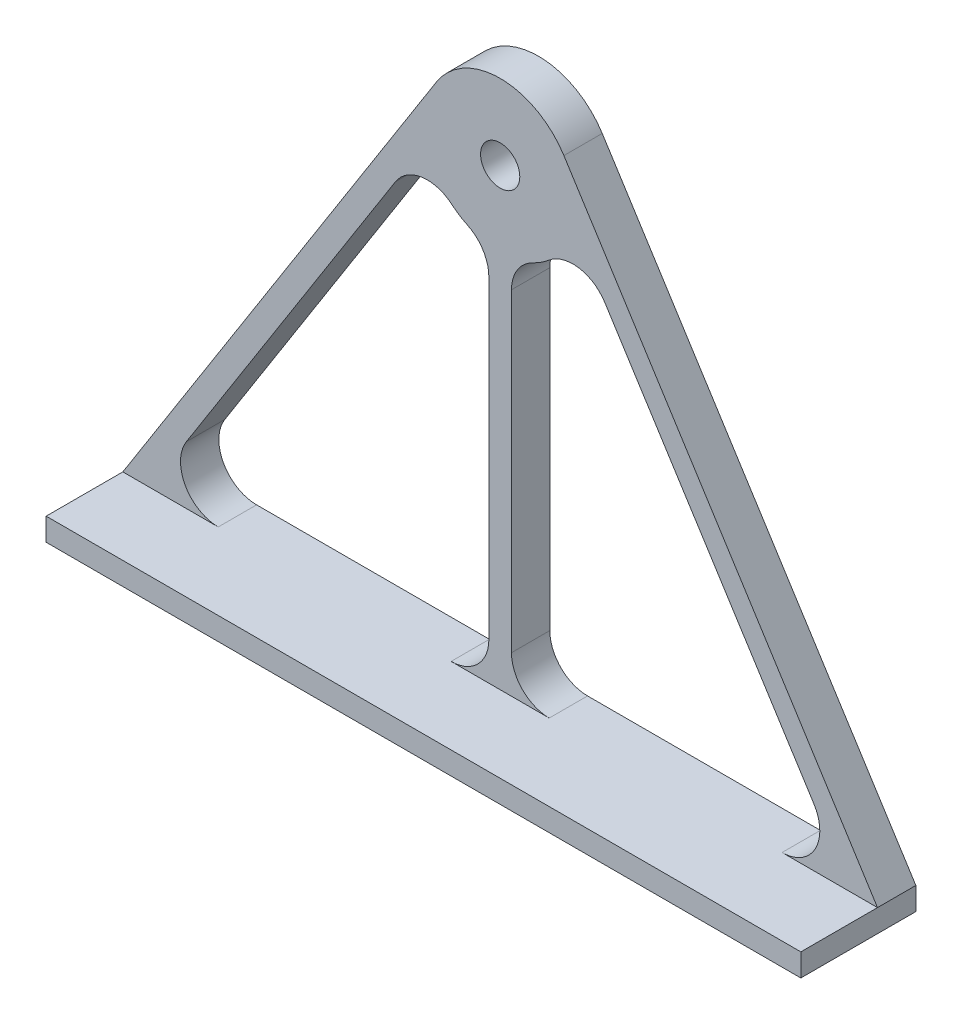
ISO-10303-21;
HEADER;
FILE_DESCRIPTION(('STEP AP214'),'2;1');
FILE_NAME('part.step','',(''),(''),'','','');
FILE_SCHEMA(('AUTOMOTIVE_DESIGN { 1 0 10303 214 1 1 1 1 }'));
ENDSEC;
DATA;
#1=APPLICATION_CONTEXT('core data for automotive mechanical design processes');
#2=APPLICATION_PROTOCOL_DEFINITION('international standard','automotive_design',2000,#1);
#3=PRODUCT_CONTEXT('',#1,'mechanical');
#4=PRODUCT('Part','Part','',(#3));
#5=PRODUCT_RELATED_PRODUCT_CATEGORY('part','',(#4));
#6=PRODUCT_DEFINITION_FORMATION('','',#4);
#7=PRODUCT_DEFINITION_CONTEXT('part definition',#1,'design');
#8=PRODUCT_DEFINITION('design','',#6,#7);
#9=PRODUCT_DEFINITION_SHAPE('','',#8);
#10=(LENGTH_UNIT() NAMED_UNIT(*) SI_UNIT(.MILLI.,.METRE.));
#11=(NAMED_UNIT(*) PLANE_ANGLE_UNIT() SI_UNIT($,.RADIAN.));
#12=(NAMED_UNIT(*) SI_UNIT($,.STERADIAN.) SOLID_ANGLE_UNIT());
#13=UNCERTAINTY_MEASURE_WITH_UNIT(LENGTH_MEASURE(1.E-05),#10,'distance_accuracy_value','');
#14=(GEOMETRIC_REPRESENTATION_CONTEXT(3) GLOBAL_UNCERTAINTY_ASSIGNED_CONTEXT((#13)) GLOBAL_UNIT_ASSIGNED_CONTEXT((#10,
#11,#12)) REPRESENTATION_CONTEXT('',''));
#15=CARTESIAN_POINT('',(0.,0.,0.));
#16=DIRECTION('',(0.,0.,1.));
#17=DIRECTION('',(1.,0.,0.));
#18=AXIS2_PLACEMENT_3D('',#15,#16,#17);
#19=CARTESIAN_POINT('',(0.,60.1642635,5.08));
#20=DIRECTION('',(0.,0.,-1.));
#21=DIRECTION('',(-1.,0.,0.));
#22=AXIS2_PLACEMENT_3D('',#19,#20,#21);
#23=PLANE('',#22);
#24=CARTESIAN_POINT('',(0.,60.1642635,5.08));
#25=DIRECTION('',(0.,0.,1.));
#26=DIRECTION('',(1.,0.,0.));
#27=AXIS2_PLACEMENT_3D('',#24,#25,#26);
#28=CIRCLE('',#27,2.6);
#29=CARTESIAN_POINT('',(2.6,60.1642635,5.08));
#30=VERTEX_POINT('',#29);
#31=EDGE_CURVE('E401',#30,#30,#28,.T.);
#32=ORIENTED_EDGE('',*,*,#31,.F.);
#33=EDGE_LOOP('',(#32));
#34=FACE_BOUND('',#33,.T.);
#35=DIRECTION('',(-1.,0.,0.));
#36=VECTOR('',#35,1.);
#37=CARTESIAN_POINT('',(-50.,0.,5.08));
#38=LINE('',#37,#36);
#39=CARTESIAN_POINT('',(50.,0.,5.08));
#40=VERTEX_POINT('',#39);
#41=CARTESIAN_POINT('',(37.3554750583701,0.,5.08));
#42=VERTEX_POINT('',#41);
#43=EDGE_CURVE('E51',#40,#42,#38,.T.);
#44=ORIENTED_EDGE('',*,*,#43,.F.);
#45=DIRECTION('',(-0.535595766391063,0.844474496372726,0.));
#46=VECTOR('',#45,1.);
#47=CARTESIAN_POINT('',(8.44474496372722,65.5202211639106,5.08));
#48=LINE('',#47,#46);
#49=CARTESIAN_POINT('',(8.44474496372722,65.5202211639106,5.08));
#50=VERTEX_POINT('',#49);
#51=EDGE_CURVE('E409',#40,#50,#48,.T.);
#52=ORIENTED_EDGE('',*,*,#51,.T.);
#53=CARTESIAN_POINT('',(0.,60.1642635,5.08));
#54=DIRECTION('',(0.,0.,1.));
#55=DIRECTION('',(-1.,0.,0.));
#56=AXIS2_PLACEMENT_3D('',#53,#54,#55);
#57=CIRCLE('',#56,9.99999999999999);
#58=CARTESIAN_POINT('',(-8.44474496372726,65.5202211639106,5.08));
#59=VERTEX_POINT('',#58);
#60=EDGE_CURVE('E412',#50,#59,#57,.T.);
#61=ORIENTED_EDGE('',*,*,#60,.T.);
#62=DIRECTION('',(-0.535595766391063,-0.844474496372727,0.));
#63=VECTOR('',#62,1.);
#64=CARTESIAN_POINT('',(-8.44474496372727,65.5202211639106,5.08));
#65=LINE('',#64,#63);
#66=CARTESIAN_POINT('',(-50.,0.,5.08));
#67=VERTEX_POINT('',#66);
#68=EDGE_CURVE('E416',#59,#67,#65,.T.);
#69=ORIENTED_EDGE('',*,*,#68,.T.);
#70=CARTESIAN_POINT('',(-37.35547505837,0.,5.08));
#71=VERTEX_POINT('',#70);
#72=EDGE_CURVE('E49',#71,#67,#38,.T.);
#73=ORIENTED_EDGE('',*,*,#72,.F.);
#74=CARTESIAN_POINT('',(-37.3554750583701,4.99999999999999,5.08));
#75=DIRECTION('',(0.,0.,1.));
#76=DIRECTION('',(1.,0.,0.));
#77=AXIS2_PLACEMENT_3D('',#74,#75,#76);
#78=CIRCLE('',#77,5.);
#79=CARTESIAN_POINT('',(-41.5778475402337,7.67797883195537,5.08));
#80=VERTEX_POINT('',#79);
#81=EDGE_CURVE('E320',#80,#71,#78,.T.);
#82=ORIENTED_EDGE('',*,*,#81,.F.);
#83=DIRECTION('',(-0.535595766391063,-0.844474496372727,0.));
#84=VECTOR('',#83,1.);
#85=CARTESIAN_POINT('',(-13.8735249585514,51.3594179463033,5.08));
#86=LINE('',#85,#84);
#87=CARTESIAN_POINT('',(-13.8735249585514,51.3594179463033,5.08));
#88=VERTEX_POINT('',#87);
#89=EDGE_CURVE('E341',#88,#80,#86,.T.);
#90=ORIENTED_EDGE('',*,*,#89,.F.);
#91=CARTESIAN_POINT('',(-9.65115247668774,48.681439114348,5.08));
#92=DIRECTION('',(0.,0.,1.));
#93=DIRECTION('',(-1.,0.,0.));
#94=AXIS2_PLACEMENT_3D('',#91,#92,#93);
#95=CIRCLE('',#94,5.);
#96=CARTESIAN_POINT('',(-6.43410165112516,52.5090472428987,5.08));
#97=VERTEX_POINT('',#96);
#98=EDGE_CURVE('E337',#97,#88,#95,.T.);
#99=ORIENTED_EDGE('',*,*,#98,.F.);
#100=CARTESIAN_POINT('',(0.,60.1642635,5.08));
#101=DIRECTION('',(0.,0.,-1.));
#102=DIRECTION('',(1.,0.,0.));
#103=AXIS2_PLACEMENT_3D('',#100,#101,#102);
#104=CIRCLE('',#103,9.99999999999997);
#105=CARTESIAN_POINT('',(-4.33333333333334,51.1519262769361,5.08));
#106=VERTEX_POINT('',#105);
#107=EDGE_CURVE('E334',#106,#97,#104,.T.);
#108=ORIENTED_EDGE('',*,*,#107,.F.);
#109=CARTESIAN_POINT('',(-6.5,46.6457576654042,5.08));
#110=DIRECTION('',(0.,0.,1.));
#111=DIRECTION('',(1.,0.,0.));
#112=AXIS2_PLACEMENT_3D('',#109,#110,#111);
#113=CIRCLE('',#112,5.);
#114=CARTESIAN_POINT('',(-1.5,46.6457576654042,5.08));
#115=VERTEX_POINT('',#114);
#116=EDGE_CURVE('E331',#115,#106,#113,.T.);
#117=ORIENTED_EDGE('',*,*,#116,.F.);
#118=DIRECTION('',(0.,1.,0.));
#119=VECTOR('',#118,1.);
#120=CARTESIAN_POINT('',(-1.49999999999999,5.00000000000004,5.08));
#121=LINE('',#120,#119);
#122=CARTESIAN_POINT('',(-1.49999999999999,5.00000000000004,5.08));
#123=VERTEX_POINT('',#122);
#124=EDGE_CURVE('E328',#123,#115,#121,.T.);
#125=ORIENTED_EDGE('',*,*,#124,.F.);
#126=CARTESIAN_POINT('',(-6.49999999999999,5.00000000000001,5.08));
#127=DIRECTION('',(0.,0.,1.));
#128=DIRECTION('',(1.,0.,0.));
#129=AXIS2_PLACEMENT_3D('',#126,#127,#128);
#130=CIRCLE('',#129,5.);
#131=CARTESIAN_POINT('',(-6.50000000000003,0.,5.08));
#132=VERTEX_POINT('',#131);
#133=EDGE_CURVE('E324',#132,#123,#130,.T.);
#134=ORIENTED_EDGE('',*,*,#133,.F.);
#135=CARTESIAN_POINT('',(6.50000000000004,0.,5.08));
#136=VERTEX_POINT('',#135);
#137=EDGE_CURVE('E11',#136,#132,#38,.T.);
#138=ORIENTED_EDGE('',*,*,#137,.F.);
#139=CARTESIAN_POINT('',(6.50000000000001,5.00000000000001,5.08));
#140=DIRECTION('',(0.,0.,1.));
#141=DIRECTION('',(-1.,0.,0.));
#142=AXIS2_PLACEMENT_3D('',#139,#140,#141);
#143=CIRCLE('',#142,5.);
#144=CARTESIAN_POINT('',(1.50000000000001,5.00000000000004,5.08));
#145=VERTEX_POINT('',#144);
#146=EDGE_CURVE('E244',#145,#136,#143,.T.);
#147=ORIENTED_EDGE('',*,*,#146,.F.);
#148=DIRECTION('',(0.,-1.,0.));
#149=VECTOR('',#148,1.);
#150=CARTESIAN_POINT('',(1.50000000000001,5.00000000000004,5.08));
#151=LINE('',#150,#149);
#152=CARTESIAN_POINT('',(1.5,46.6457576654043,5.08));
#153=VERTEX_POINT('',#152);
#154=EDGE_CURVE('E264',#153,#145,#151,.T.);
#155=ORIENTED_EDGE('',*,*,#154,.F.);
#156=CARTESIAN_POINT('',(6.5,46.6457576654043,5.08));
#157=DIRECTION('',(0.,0.,1.));
#158=DIRECTION('',(-1.,0.,0.));
#159=AXIS2_PLACEMENT_3D('',#156,#157,#158);
#160=CIRCLE('',#159,5.);
#161=CARTESIAN_POINT('',(4.33333333333331,51.1519262769362,5.08));
#162=VERTEX_POINT('',#161);
#163=EDGE_CURVE('E261',#162,#153,#160,.T.);
#164=ORIENTED_EDGE('',*,*,#163,.F.);
#165=CARTESIAN_POINT('',(-2.05564731903252E-13,60.1642635000002,5.08));
#166=DIRECTION('',(0.,0.,-1.));
#167=DIRECTION('',(1.,0.,0.));
#168=AXIS2_PLACEMENT_3D('',#165,#166,#167);
#169=CIRCLE('',#168,10.0000000000003);
#170=CARTESIAN_POINT('',(6.43410165112491,52.5090472428989,5.08));
#171=VERTEX_POINT('',#170);
#172=EDGE_CURVE('E258',#171,#162,#169,.T.);
#173=ORIENTED_EDGE('',*,*,#172,.F.);
#174=CARTESIAN_POINT('',(9.65115247668729,48.6814391143482,5.08));
#175=DIRECTION('',(0.,0.,1.));
#176=DIRECTION('',(1.,0.,0.));
#177=AXIS2_PLACEMENT_3D('',#174,#175,#176);
#178=CIRCLE('',#177,4.99999999999994);
#179=CARTESIAN_POINT('',(13.8735249585513,51.3594179463033,5.08));
#180=VERTEX_POINT('',#179);
#181=EDGE_CURVE('E255',#180,#171,#178,.T.);
#182=ORIENTED_EDGE('',*,*,#181,.F.);
#183=DIRECTION('',(-0.535595766391063,0.844474496372726,0.));
#184=VECTOR('',#183,1.);
#185=CARTESIAN_POINT('',(13.8735249585513,51.3594179463033,5.08));
#186=LINE('',#185,#184);
#187=CARTESIAN_POINT('',(41.5778475402337,7.6779788319553,5.08));
#188=VERTEX_POINT('',#187);
#189=EDGE_CURVE('E252',#188,#180,#186,.T.);
#190=ORIENTED_EDGE('',*,*,#189,.F.);
#191=CARTESIAN_POINT('',(37.35547505837,5.,5.08));
#192=DIRECTION('',(0.,0.,1.));
#193=DIRECTION('',(-1.,0.,0.));
#194=AXIS2_PLACEMENT_3D('',#191,#192,#193);
#195=CIRCLE('',#194,5.00000000000003);
#196=EDGE_CURVE('E248',#42,#188,#195,.T.);
#197=ORIENTED_EDGE('',*,*,#196,.F.);
#198=EDGE_LOOP('',(#44,#52,#61,#69,#73,#82,#90,#99,#108,#117,#125,#134,#138,#147,#155,#164,#173,
#182,#190,#197));
#199=FACE_BOUND('',#198,.T.);
#200=ADVANCED_FACE('F39',(#34,#199),#23,.F.);
#201=CARTESIAN_POINT('',(0.,60.1642635,0.));
#202=DIRECTION('',(0.,0.,-1.));
#203=DIRECTION('',(-1.,0.,0.));
#204=AXIS2_PLACEMENT_3D('',#201,#202,#203);
#205=PLANE('',#204);
#206=DIRECTION('',(0.,1.,0.));
#207=VECTOR('',#206,1.);
#208=CARTESIAN_POINT('',(50.,-3.,0.));
#209=LINE('',#208,#207);
#210=CARTESIAN_POINT('',(50.,-3.,0.));
#211=VERTEX_POINT('',#210);
#212=CARTESIAN_POINT('',(50.,0.,0.));
#213=VERTEX_POINT('',#212);
#214=EDGE_CURVE('E405',#211,#213,#209,.T.);
#215=ORIENTED_EDGE('',*,*,#214,.F.);
#216=DIRECTION('',(1.,0.,0.));
#217=VECTOR('',#216,1.);
#218=CARTESIAN_POINT('',(-50.,-3.,0.));
#219=LINE('',#218,#217);
#220=CARTESIAN_POINT('',(-50.,-3.,0.));
#221=VERTEX_POINT('',#220);
#222=EDGE_CURVE('E413',#221,#211,#219,.T.);
#223=ORIENTED_EDGE('',*,*,#222,.F.);
#224=DIRECTION('',(0.,-1.,0.));
#225=VECTOR('',#224,1.);
#226=CARTESIAN_POINT('',(-50.,0.,0.));
#227=LINE('',#226,#225);
#228=CARTESIAN_POINT('',(-50.,0.,0.));
#229=VERTEX_POINT('',#228);
#230=EDGE_CURVE('E208',#229,#221,#227,.T.);
#231=ORIENTED_EDGE('',*,*,#230,.F.);
#232=DIRECTION('',(-0.535595766391063,-0.844474496372727,0.));
#233=VECTOR('',#232,1.);
#234=CARTESIAN_POINT('',(-8.44474496372727,65.5202211639106,0.));
#235=LINE('',#234,#233);
#236=CARTESIAN_POINT('',(-8.44474496372726,65.5202211639106,0.));
#237=VERTEX_POINT('',#236);
#238=EDGE_CURVE('E429',#237,#229,#235,.T.);
#239=ORIENTED_EDGE('',*,*,#238,.F.);
#240=CARTESIAN_POINT('',(0.,60.1642635,0.));
#241=DIRECTION('',(0.,0.,1.));
#242=DIRECTION('',(-1.,0.,0.));
#243=AXIS2_PLACEMENT_3D('',#240,#241,#242);
#244=CIRCLE('',#243,9.99999999999999);
#245=CARTESIAN_POINT('',(8.44474496372722,65.5202211639106,0.));
#246=VERTEX_POINT('',#245);
#247=EDGE_CURVE('E426',#246,#237,#244,.T.);
#248=ORIENTED_EDGE('',*,*,#247,.F.);
#249=DIRECTION('',(-0.535595766391063,0.844474496372726,0.));
#250=VECTOR('',#249,1.);
#251=CARTESIAN_POINT('',(8.44474496372722,65.5202211639106,0.));
#252=LINE('',#251,#250);
#253=EDGE_CURVE('E423',#213,#246,#252,.T.);
#254=ORIENTED_EDGE('',*,*,#253,.F.);
#255=EDGE_LOOP('',(#215,#223,#231,#239,#248,#254));
#256=FACE_BOUND('',#255,.T.);
#257=CARTESIAN_POINT('',(0.,60.1642635,0.));
#258=DIRECTION('',(0.,0.,1.));
#259=DIRECTION('',(1.,0.,0.));
#260=AXIS2_PLACEMENT_3D('',#257,#258,#259);
#261=CIRCLE('',#260,2.6);
#262=CARTESIAN_POINT('',(2.6,60.1642635,0.));
#263=VERTEX_POINT('',#262);
#264=EDGE_CURVE('E400',#263,#263,#261,.T.);
#265=ORIENTED_EDGE('',*,*,#264,.T.);
#266=EDGE_LOOP('',(#265));
#267=FACE_BOUND('',#266,.T.);
#268=DIRECTION('',(-0.535595766391063,-0.844474496372727,0.));
#269=VECTOR('',#268,1.);
#270=CARTESIAN_POINT('',(-13.8735249585514,51.3594179463033,0.));
#271=LINE('',#270,#269);
#272=CARTESIAN_POINT('',(-13.8735249585514,51.3594179463033,0.));
#273=VERTEX_POINT('',#272);
#274=CARTESIAN_POINT('',(-41.5778475402337,7.67797883195537,0.));
#275=VERTEX_POINT('',#274);
#276=EDGE_CURVE('E325',#273,#275,#271,.T.);
#277=ORIENTED_EDGE('',*,*,#276,.T.);
#278=CARTESIAN_POINT('',(-37.3554750583701,4.99999999999999,0.));
#279=DIRECTION('',(0.,0.,1.));
#280=DIRECTION('',(1.,0.,0.));
#281=AXIS2_PLACEMENT_3D('',#278,#279,#280);
#282=CIRCLE('',#281,5.);
#283=CARTESIAN_POINT('',(-37.35547505837,0.,0.));
#284=VERTEX_POINT('',#283);
#285=EDGE_CURVE('E319',#275,#284,#282,.T.);
#286=ORIENTED_EDGE('',*,*,#285,.T.);
#287=DIRECTION('',(1.,0.,0.));
#288=VECTOR('',#287,1.);
#289=CARTESIAN_POINT('',(-37.35547505837,0.,0.));
#290=LINE('',#289,#288);
#291=CARTESIAN_POINT('',(-6.50000000000003,0.,0.));
#292=VERTEX_POINT('',#291);
#293=EDGE_CURVE('E348',#284,#292,#290,.T.);
#294=ORIENTED_EDGE('',*,*,#293,.T.);
#295=CARTESIAN_POINT('',(-6.49999999999999,5.00000000000001,0.));
#296=DIRECTION('',(0.,0.,1.));
#297=DIRECTION('',(1.,0.,0.));
#298=AXIS2_PLACEMENT_3D('',#295,#296,#297);
#299=CIRCLE('',#298,5.);
#300=CARTESIAN_POINT('',(-1.49999999999999,5.00000000000004,0.));
#301=VERTEX_POINT('',#300);
#302=EDGE_CURVE('E352',#292,#301,#299,.T.);
#303=ORIENTED_EDGE('',*,*,#302,.T.);
#304=DIRECTION('',(0.,1.,0.));
#305=VECTOR('',#304,1.);
#306=CARTESIAN_POINT('',(-1.49999999999999,5.00000000000004,0.));
#307=LINE('',#306,#305);
#308=CARTESIAN_POINT('',(-1.5,46.6457576654042,0.));
#309=VERTEX_POINT('',#308);
#310=EDGE_CURVE('E356',#301,#309,#307,.T.);
#311=ORIENTED_EDGE('',*,*,#310,.T.);
#312=CARTESIAN_POINT('',(-6.5,46.6457576654042,0.));
#313=DIRECTION('',(0.,0.,1.));
#314=DIRECTION('',(1.,0.,0.));
#315=AXIS2_PLACEMENT_3D('',#312,#313,#314);
#316=CIRCLE('',#315,5.);
#317=CARTESIAN_POINT('',(-4.33333333333334,51.1519262769361,0.));
#318=VERTEX_POINT('',#317);
#319=EDGE_CURVE('E360',#309,#318,#316,.T.);
#320=ORIENTED_EDGE('',*,*,#319,.T.);
#321=CARTESIAN_POINT('',(0.,60.1642635,0.));
#322=DIRECTION('',(0.,0.,-1.));
#323=DIRECTION('',(1.,0.,0.));
#324=AXIS2_PLACEMENT_3D('',#321,#322,#323);
#325=CIRCLE('',#324,9.99999999999997);
#326=CARTESIAN_POINT('',(-6.43410165112516,52.5090472428987,0.));
#327=VERTEX_POINT('',#326);
#328=EDGE_CURVE('E364',#318,#327,#325,.T.);
#329=ORIENTED_EDGE('',*,*,#328,.T.);
#330=CARTESIAN_POINT('',(-9.65115247668774,48.681439114348,0.));
#331=DIRECTION('',(0.,0.,1.));
#332=DIRECTION('',(-1.,0.,0.));
#333=AXIS2_PLACEMENT_3D('',#330,#331,#332);
#334=CIRCLE('',#333,5.);
#335=EDGE_CURVE('E368',#327,#273,#334,.T.);
#336=ORIENTED_EDGE('',*,*,#335,.T.);
#337=EDGE_LOOP('',(#277,#286,#294,#303,#311,#320,#329,#336));
#338=FACE_BOUND('',#337,.T.);
#339=DIRECTION('',(0.,-1.,0.));
#340=VECTOR('',#339,1.);
#341=CARTESIAN_POINT('',(1.50000000000001,5.00000000000004,0.));
#342=LINE('',#341,#340);
#343=CARTESIAN_POINT('',(1.5,46.6457576654043,0.));
#344=VERTEX_POINT('',#343);
#345=CARTESIAN_POINT('',(1.50000000000001,5.00000000000004,0.));
#346=VERTEX_POINT('',#345);
#347=EDGE_CURVE('E249',#344,#346,#342,.T.);
#348=ORIENTED_EDGE('',*,*,#347,.T.);
#349=CARTESIAN_POINT('',(6.50000000000001,5.00000000000001,0.));
#350=DIRECTION('',(0.,0.,1.));
#351=DIRECTION('',(-1.,0.,0.));
#352=AXIS2_PLACEMENT_3D('',#349,#350,#351);
#353=CIRCLE('',#352,5.);
#354=CARTESIAN_POINT('',(6.50000000000004,0.,0.));
#355=VERTEX_POINT('',#354);
#356=EDGE_CURVE('E66',#346,#355,#353,.T.);
#357=ORIENTED_EDGE('',*,*,#356,.T.);
#358=DIRECTION('',(1.,0.,0.));
#359=VECTOR('',#358,1.);
#360=CARTESIAN_POINT('',(37.3554750583701,0.,0.));
#361=LINE('',#360,#359);
#362=CARTESIAN_POINT('',(37.3554750583701,0.,0.));
#363=VERTEX_POINT('',#362);
#364=EDGE_CURVE('E270',#355,#363,#361,.T.);
#365=ORIENTED_EDGE('',*,*,#364,.T.);
#366=CARTESIAN_POINT('',(37.35547505837,5.,0.));
#367=DIRECTION('',(0.,0.,1.));
#368=DIRECTION('',(-1.,0.,0.));
#369=AXIS2_PLACEMENT_3D('',#366,#367,#368);
#370=CIRCLE('',#369,5.00000000000003);
#371=CARTESIAN_POINT('',(41.5778475402337,7.6779788319553,0.));
#372=VERTEX_POINT('',#371);
#373=EDGE_CURVE('E274',#363,#372,#370,.T.);
#374=ORIENTED_EDGE('',*,*,#373,.T.);
#375=DIRECTION('',(-0.535595766391063,0.844474496372726,0.));
#376=VECTOR('',#375,1.);
#377=CARTESIAN_POINT('',(13.8735249585513,51.3594179463033,0.));
#378=LINE('',#377,#376);
#379=CARTESIAN_POINT('',(13.8735249585513,51.3594179463033,0.));
#380=VERTEX_POINT('',#379);
#381=EDGE_CURVE('E278',#372,#380,#378,.T.);
#382=ORIENTED_EDGE('',*,*,#381,.T.);
#383=CARTESIAN_POINT('',(9.65115247668729,48.6814391143482,0.));
#384=DIRECTION('',(0.,0.,1.));
#385=DIRECTION('',(1.,0.,0.));
#386=AXIS2_PLACEMENT_3D('',#383,#384,#385);
#387=CIRCLE('',#386,4.99999999999994);
#388=CARTESIAN_POINT('',(6.43410165112491,52.5090472428989,0.));
#389=VERTEX_POINT('',#388);
#390=EDGE_CURVE('E282',#380,#389,#387,.T.);
#391=ORIENTED_EDGE('',*,*,#390,.T.);
#392=CARTESIAN_POINT('',(-2.05564731903252E-13,60.1642635000002,0.));
#393=DIRECTION('',(0.,0.,-1.));
#394=DIRECTION('',(1.,0.,0.));
#395=AXIS2_PLACEMENT_3D('',#392,#393,#394);
#396=CIRCLE('',#395,10.0000000000003);
#397=CARTESIAN_POINT('',(4.33333333333331,51.1519262769362,0.));
#398=VERTEX_POINT('',#397);
#399=EDGE_CURVE('E286',#389,#398,#396,.T.);
#400=ORIENTED_EDGE('',*,*,#399,.T.);
#401=CARTESIAN_POINT('',(6.5,46.6457576654043,0.));
#402=DIRECTION('',(0.,0.,1.));
#403=DIRECTION('',(-1.,0.,0.));
#404=AXIS2_PLACEMENT_3D('',#401,#402,#403);
#405=CIRCLE('',#404,5.);
#406=EDGE_CURVE('E290',#398,#344,#405,.T.);
#407=ORIENTED_EDGE('',*,*,#406,.T.);
#408=EDGE_LOOP('',(#348,#357,#365,#374,#382,#391,#400,#407));
#409=FACE_BOUND('',#408,.T.);
#410=ADVANCED_FACE('F467',(#256,#267,#338,#409),#205,.T.);
#411=CARTESIAN_POINT('',(50.,-3.,5.08));
#412=DIRECTION('',(-1.,0.,0.));
#413=DIRECTION('',(0.,0.,1.));
#414=AXIS2_PLACEMENT_3D('',#411,#412,#413);
#415=PLANE('',#414);
#416=ORIENTED_EDGE('',*,*,#214,.T.);
#417=DIRECTION('',(0.,0.,-1.));
#418=VECTOR('',#417,1.);
#419=CARTESIAN_POINT('',(50.,0.,5.08));
#420=LINE('',#419,#418);
#421=EDGE_CURVE('E43',#40,#213,#420,.T.);
#422=ORIENTED_EDGE('',*,*,#421,.F.);
#423=DIRECTION('',(0.,0.,-1.));
#424=VECTOR('',#423,1.);
#425=CARTESIAN_POINT('',(50.,0.,15.24));
#426=LINE('',#425,#424);
#427=CARTESIAN_POINT('',(50.,0.,15.24));
#428=VERTEX_POINT('',#427);
#429=EDGE_CURVE('E240',#428,#40,#426,.T.);
#430=ORIENTED_EDGE('',*,*,#429,.F.);
#431=DIRECTION('',(0.,1.,0.));
#432=VECTOR('',#431,1.);
#433=CARTESIAN_POINT('',(50.,0.,15.24));
#434=LINE('',#433,#432);
#435=CARTESIAN_POINT('',(50.,-3.,15.24));
#436=VERTEX_POINT('',#435);
#437=EDGE_CURVE('E222',#436,#428,#434,.T.);
#438=ORIENTED_EDGE('',*,*,#437,.F.);
#439=DIRECTION('',(0.,0.,-1.));
#440=VECTOR('',#439,1.);
#441=CARTESIAN_POINT('',(50.,-3.,5.08));
#442=LINE('',#441,#440);
#443=EDGE_CURVE('E213',#436,#211,#442,.T.);
#444=ORIENTED_EDGE('',*,*,#443,.T.);
#445=EDGE_LOOP('',(#416,#422,#430,#438,#444));
#446=FACE_BOUND('',#445,.T.);
#447=ADVANCED_FACE('F41',(#446),#415,.F.);
#448=CARTESIAN_POINT('',(8.44474496372722,65.5202211639106,5.08));
#449=DIRECTION('',(-0.844474496372726,-0.535595766391063,0.));
#450=DIRECTION('',(0.535595766391063,-0.844474496372726,0.));
#451=AXIS2_PLACEMENT_3D('',#448,#449,#450);
#452=PLANE('',#451);
#453=ORIENTED_EDGE('',*,*,#253,.T.);
#454=DIRECTION('',(0.,0.,-1.));
#455=VECTOR('',#454,1.);
#456=CARTESIAN_POINT('',(8.44474496372722,65.5202211639106,5.08));
#457=LINE('',#456,#455);
#458=EDGE_CURVE('E443',#50,#246,#457,.T.);
#459=ORIENTED_EDGE('',*,*,#458,.F.);
#460=ORIENTED_EDGE('',*,*,#51,.F.);
#461=ORIENTED_EDGE('',*,*,#421,.T.);
#462=EDGE_LOOP('',(#453,#459,#460,#461));
#463=FACE_BOUND('',#462,.T.);
#464=ADVANCED_FACE('F474',(#463),#452,.F.);
#465=CARTESIAN_POINT('',(0.,60.1642635,5.08));
#466=DIRECTION('',(0.,0.,-1.));
#467=DIRECTION('',(-1.,0.,0.));
#468=AXIS2_PLACEMENT_3D('',#465,#466,#467);
#469=CYLINDRICAL_SURFACE('',#468,9.99999999999999);
#470=ORIENTED_EDGE('',*,*,#247,.T.);
#471=DIRECTION('',(0.,0.,-1.));
#472=VECTOR('',#471,1.);
#473=CARTESIAN_POINT('',(-8.44474496372726,65.5202211639106,5.08));
#474=LINE('',#473,#472);
#475=EDGE_CURVE('E440',#59,#237,#474,.T.);
#476=ORIENTED_EDGE('',*,*,#475,.F.);
#477=ORIENTED_EDGE('',*,*,#60,.F.);
#478=ORIENTED_EDGE('',*,*,#458,.T.);
#479=EDGE_LOOP('',(#470,#476,#477,#478));
#480=FACE_BOUND('',#479,.T.);
#481=ADVANCED_FACE('F476',(#480),#469,.T.);
#482=CARTESIAN_POINT('',(-8.44474496372727,65.5202211639106,5.08));
#483=DIRECTION('',(0.844474496372727,-0.535595766391063,0.));
#484=DIRECTION('',(0.535595766391063,0.844474496372727,0.));
#485=AXIS2_PLACEMENT_3D('',#482,#483,#484);
#486=PLANE('',#485);
#487=ORIENTED_EDGE('',*,*,#238,.T.);
#488=DIRECTION('',(0.,0.,-1.));
#489=VECTOR('',#488,1.);
#490=CARTESIAN_POINT('',(-50.,0.,5.08));
#491=LINE('',#490,#489);
#492=EDGE_CURVE('E212',#67,#229,#491,.T.);
#493=ORIENTED_EDGE('',*,*,#492,.F.);
#494=ORIENTED_EDGE('',*,*,#68,.F.);
#495=ORIENTED_EDGE('',*,*,#475,.T.);
#496=EDGE_LOOP('',(#487,#493,#494,#495));
#497=FACE_BOUND('',#496,.T.);
#498=ADVANCED_FACE('F477',(#497),#486,.F.);
#499=CARTESIAN_POINT('',(-50.,0.,5.08));
#500=DIRECTION('',(1.,0.,0.));
#501=DIRECTION('',(0.,0.,-1.));
#502=AXIS2_PLACEMENT_3D('',#499,#500,#501);
#503=PLANE('',#502);
#504=ORIENTED_EDGE('',*,*,#230,.T.);
#505=DIRECTION('',(0.,0.,-1.));
#506=VECTOR('',#505,1.);
#507=CARTESIAN_POINT('',(-50.,-3.,5.08));
#508=LINE('',#507,#506);
#509=CARTESIAN_POINT('',(-50.,-3.,15.24));
#510=VERTEX_POINT('',#509);
#511=EDGE_CURVE('E200',#510,#221,#508,.T.);
#512=ORIENTED_EDGE('',*,*,#511,.F.);
#513=DIRECTION('',(0.,-1.,0.));
#514=VECTOR('',#513,1.);
#515=CARTESIAN_POINT('',(-50.,-3.,15.24));
#516=LINE('',#515,#514);
#517=CARTESIAN_POINT('',(-50.,0.,15.24));
#518=VERTEX_POINT('',#517);
#519=EDGE_CURVE('E205',#518,#510,#516,.T.);
#520=ORIENTED_EDGE('',*,*,#519,.F.);
#521=DIRECTION('',(0.,0.,-1.));
#522=VECTOR('',#521,1.);
#523=CARTESIAN_POINT('',(-50.,0.,15.24));
#524=LINE('',#523,#522);
#525=EDGE_CURVE('E236',#518,#67,#524,.T.);
#526=ORIENTED_EDGE('',*,*,#525,.T.);
#527=ORIENTED_EDGE('',*,*,#492,.T.);
#528=EDGE_LOOP('',(#504,#512,#520,#526,#527));
#529=FACE_BOUND('',#528,.T.);
#530=ADVANCED_FACE('F202',(#529),#503,.F.);
#531=CARTESIAN_POINT('',(-50.,-3.,5.08));
#532=DIRECTION('',(0.,1.,0.));
#533=DIRECTION('',(0.,0.,1.));
#534=AXIS2_PLACEMENT_3D('',#531,#532,#533);
#535=PLANE('',#534);
#536=ORIENTED_EDGE('',*,*,#222,.T.);
#537=ORIENTED_EDGE('',*,*,#443,.F.);
#538=DIRECTION('',(1.,0.,0.));
#539=VECTOR('',#538,1.);
#540=CARTESIAN_POINT('',(50.,-3.,15.24));
#541=LINE('',#540,#539);
#542=EDGE_CURVE('E216',#510,#436,#541,.T.);
#543=ORIENTED_EDGE('',*,*,#542,.F.);
#544=ORIENTED_EDGE('',*,*,#511,.T.);
#545=EDGE_LOOP('',(#536,#537,#543,#544));
#546=FACE_BOUND('',#545,.T.);
#547=ADVANCED_FACE('F217',(#546),#535,.F.);
#548=CARTESIAN_POINT('',(0.,60.1642635,5.08));
#549=DIRECTION('',(0.,0.,-1.));
#550=DIRECTION('',(-1.,0.,0.));
#551=AXIS2_PLACEMENT_3D('',#548,#549,#550);
#552=CYLINDRICAL_SURFACE('',#551,2.6);
#553=ORIENTED_EDGE('',*,*,#31,.T.);
#554=EDGE_LOOP('',(#553));
#555=FACE_BOUND('',#554,.T.);
#556=ORIENTED_EDGE('',*,*,#264,.F.);
#557=EDGE_LOOP('',(#556));
#558=FACE_BOUND('',#557,.T.);
#559=ADVANCED_FACE('F495',(#555,#558),#552,.F.);
#560=CARTESIAN_POINT('',(-37.3554750583701,4.99999999999999,5.08));
#561=DIRECTION('',(0.,0.,-1.));
#562=DIRECTION('',(-1.,0.,0.));
#563=AXIS2_PLACEMENT_3D('',#560,#561,#562);
#564=CYLINDRICAL_SURFACE('',#563,5.);
#565=ORIENTED_EDGE('',*,*,#285,.F.);
#566=DIRECTION('',(0.,0.,-1.));
#567=VECTOR('',#566,1.);
#568=CARTESIAN_POINT('',(-41.5778475402337,7.67797883195537,5.08));
#569=LINE('',#568,#567);
#570=EDGE_CURVE('E344',#80,#275,#569,.T.);
#571=ORIENTED_EDGE('',*,*,#570,.F.);
#572=ORIENTED_EDGE('',*,*,#81,.T.);
#573=DIRECTION('',(0.,0.,-1.));
#574=VECTOR('',#573,1.);
#575=CARTESIAN_POINT('',(-37.35547505837,0.,5.08));
#576=LINE('',#575,#574);
#577=EDGE_CURVE('E396',#71,#284,#576,.T.);
#578=ORIENTED_EDGE('',*,*,#577,.T.);
#579=EDGE_LOOP('',(#565,#571,#572,#578));
#580=FACE_BOUND('',#579,.T.);
#581=ADVANCED_FACE('F502',(#580),#564,.F.);
#582=CARTESIAN_POINT('',(-37.35547505837,0.,5.08));
#583=DIRECTION('',(0.,1.,0.));
#584=DIRECTION('',(-1.,0.,0.));
#585=AXIS2_PLACEMENT_3D('',#582,#583,#584);
#586=PLANE('',#585);
#587=ORIENTED_EDGE('',*,*,#293,.F.);
#588=ORIENTED_EDGE('',*,*,#577,.F.);
#589=ORIENTED_EDGE('',*,*,#72,.T.);
#590=ORIENTED_EDGE('',*,*,#525,.F.);
#591=DIRECTION('',(-1.,0.,0.));
#592=VECTOR('',#591,1.);
#593=CARTESIAN_POINT('',(-50.,0.,15.24));
#594=LINE('',#593,#592);
#595=EDGE_CURVE('E226',#428,#518,#594,.T.);
#596=ORIENTED_EDGE('',*,*,#595,.F.);
#597=ORIENTED_EDGE('',*,*,#429,.T.);
#598=ORIENTED_EDGE('',*,*,#43,.T.);
#599=DIRECTION('',(0.,0.,-1.));
#600=VECTOR('',#599,1.);
#601=CARTESIAN_POINT('',(37.3554750583701,0.,5.08));
#602=LINE('',#601,#600);
#603=EDGE_CURVE('E313',#42,#363,#602,.T.);
#604=ORIENTED_EDGE('',*,*,#603,.T.);
#605=ORIENTED_EDGE('',*,*,#364,.F.);
#606=DIRECTION('',(0.,0.,-1.));
#607=VECTOR('',#606,1.);
#608=CARTESIAN_POINT('',(6.50000000000004,0.,5.08));
#609=LINE('',#608,#607);
#610=EDGE_CURVE('E316',#136,#355,#609,.T.);
#611=ORIENTED_EDGE('',*,*,#610,.F.);
#612=ORIENTED_EDGE('',*,*,#137,.T.);
#613=DIRECTION('',(0.,0.,-1.));
#614=VECTOR('',#613,1.);
#615=CARTESIAN_POINT('',(-6.50000000000003,0.,5.08));
#616=LINE('',#615,#614);
#617=EDGE_CURVE('E393',#132,#292,#616,.T.);
#618=ORIENTED_EDGE('',*,*,#617,.T.);
#619=EDGE_LOOP('',(#587,#588,#589,#590,#596,#597,#598,#604,#605,#611,#612,#618));
#620=FACE_BOUND('',#619,.T.);
#621=ADVANCED_FACE('F459',(#620),#586,.T.);
#622=CARTESIAN_POINT('',(-6.49999999999999,5.00000000000001,5.08));
#623=DIRECTION('',(0.,0.,-1.));
#624=DIRECTION('',(-1.,0.,0.));
#625=AXIS2_PLACEMENT_3D('',#622,#623,#624);
#626=CYLINDRICAL_SURFACE('',#625,5.);
#627=ORIENTED_EDGE('',*,*,#302,.F.);
#628=ORIENTED_EDGE('',*,*,#617,.F.);
#629=ORIENTED_EDGE('',*,*,#133,.T.);
#630=DIRECTION('',(0.,0.,-1.));
#631=VECTOR('',#630,1.);
#632=CARTESIAN_POINT('',(-1.49999999999999,5.00000000000004,5.08));
#633=LINE('',#632,#631);
#634=EDGE_CURVE('E390',#123,#301,#633,.T.);
#635=ORIENTED_EDGE('',*,*,#634,.T.);
#636=EDGE_LOOP('',(#627,#628,#629,#635));
#637=FACE_BOUND('',#636,.T.);
#638=ADVANCED_FACE('F579',(#637),#626,.F.);
#639=CARTESIAN_POINT('',(-1.49999999999999,5.00000000000004,5.08));
#640=DIRECTION('',(-1.,0.,0.));
#641=DIRECTION('',(0.,-1.,0.));
#642=AXIS2_PLACEMENT_3D('',#639,#640,#641);
#643=PLANE('',#642);
#644=ORIENTED_EDGE('',*,*,#310,.F.);
#645=ORIENTED_EDGE('',*,*,#634,.F.);
#646=ORIENTED_EDGE('',*,*,#124,.T.);
#647=DIRECTION('',(0.,0.,-1.));
#648=VECTOR('',#647,1.);
#649=CARTESIAN_POINT('',(-1.5,46.6457576654042,5.08));
#650=LINE('',#649,#648);
#651=EDGE_CURVE('E387',#115,#309,#650,.T.);
#652=ORIENTED_EDGE('',*,*,#651,.T.);
#653=EDGE_LOOP('',(#644,#645,#646,#652));
#654=FACE_BOUND('',#653,.T.);
#655=ADVANCED_FACE('F575',(#654),#643,.T.);
#656=CARTESIAN_POINT('',(-6.5,46.6457576654042,5.08));
#657=DIRECTION('',(0.,0.,-1.));
#658=DIRECTION('',(-1.,0.,0.));
#659=AXIS2_PLACEMENT_3D('',#656,#657,#658);
#660=CYLINDRICAL_SURFACE('',#659,5.);
#661=ORIENTED_EDGE('',*,*,#319,.F.);
#662=ORIENTED_EDGE('',*,*,#651,.F.);
#663=ORIENTED_EDGE('',*,*,#116,.T.);
#664=DIRECTION('',(0.,0.,-1.));
#665=VECTOR('',#664,1.);
#666=CARTESIAN_POINT('',(-4.33333333333334,51.1519262769361,5.08));
#667=LINE('',#666,#665);
#668=EDGE_CURVE('E384',#106,#318,#667,.T.);
#669=ORIENTED_EDGE('',*,*,#668,.T.);
#670=EDGE_LOOP('',(#661,#662,#663,#669));
#671=FACE_BOUND('',#670,.T.);
#672=ADVANCED_FACE('F571',(#671),#660,.F.);
#673=CARTESIAN_POINT('',(0.,60.1642635,5.08));
#674=DIRECTION('',(0.,0.,-1.));
#675=DIRECTION('',(-1.,0.,0.));
#676=AXIS2_PLACEMENT_3D('',#673,#674,#675);
#677=CYLINDRICAL_SURFACE('',#676,9.99999999999997);
#678=ORIENTED_EDGE('',*,*,#328,.F.);
#679=ORIENTED_EDGE('',*,*,#668,.F.);
#680=ORIENTED_EDGE('',*,*,#107,.T.);
#681=DIRECTION('',(0.,0.,-1.));
#682=VECTOR('',#681,1.);
#683=CARTESIAN_POINT('',(-6.43410165112516,52.5090472428987,5.08));
#684=LINE('',#683,#682);
#685=EDGE_CURVE('E381',#97,#327,#684,.T.);
#686=ORIENTED_EDGE('',*,*,#685,.T.);
#687=EDGE_LOOP('',(#678,#679,#680,#686));
#688=FACE_BOUND('',#687,.T.);
#689=ADVANCED_FACE('F567',(#688),#677,.T.);
#690=CARTESIAN_POINT('',(-9.65115247668774,48.681439114348,5.08));
#691=DIRECTION('',(0.,0.,-1.));
#692=DIRECTION('',(-1.,0.,0.));
#693=AXIS2_PLACEMENT_3D('',#690,#691,#692);
#694=CYLINDRICAL_SURFACE('',#693,5.);
#695=ORIENTED_EDGE('',*,*,#335,.F.);
#696=ORIENTED_EDGE('',*,*,#685,.F.);
#697=ORIENTED_EDGE('',*,*,#98,.T.);
#698=DIRECTION('',(0.,0.,-1.));
#699=VECTOR('',#698,1.);
#700=CARTESIAN_POINT('',(-13.8735249585514,51.3594179463033,5.08));
#701=LINE('',#700,#699);
#702=EDGE_CURVE('E378',#88,#273,#701,.T.);
#703=ORIENTED_EDGE('',*,*,#702,.T.);
#704=EDGE_LOOP('',(#695,#696,#697,#703));
#705=FACE_BOUND('',#704,.T.);
#706=ADVANCED_FACE('F563',(#705),#694,.F.);
#707=CARTESIAN_POINT('',(-13.8735249585514,51.3594179463033,5.08));
#708=DIRECTION('',(0.844474496372727,-0.535595766391063,0.));
#709=DIRECTION('',(0.535595766391063,0.844474496372727,0.));
#710=AXIS2_PLACEMENT_3D('',#707,#708,#709);
#711=PLANE('',#710);
#712=ORIENTED_EDGE('',*,*,#276,.F.);
#713=ORIENTED_EDGE('',*,*,#702,.F.);
#714=ORIENTED_EDGE('',*,*,#89,.T.);
#715=ORIENTED_EDGE('',*,*,#570,.T.);
#716=EDGE_LOOP('',(#712,#713,#714,#715));
#717=FACE_BOUND('',#716,.T.);
#718=ADVANCED_FACE('F560',(#717),#711,.T.);
#719=CARTESIAN_POINT('',(6.50000000000001,5.00000000000001,5.08));
#720=DIRECTION('',(0.,0.,-1.));
#721=DIRECTION('',(-1.,0.,0.));
#722=AXIS2_PLACEMENT_3D('',#719,#720,#721);
#723=CYLINDRICAL_SURFACE('',#722,5.);
#724=ORIENTED_EDGE('',*,*,#356,.F.);
#725=DIRECTION('',(0.,0.,-1.));
#726=VECTOR('',#725,1.);
#727=CARTESIAN_POINT('',(1.50000000000001,5.00000000000004,5.08));
#728=LINE('',#727,#726);
#729=EDGE_CURVE('E267',#145,#346,#728,.T.);
#730=ORIENTED_EDGE('',*,*,#729,.F.);
#731=ORIENTED_EDGE('',*,*,#146,.T.);
#732=ORIENTED_EDGE('',*,*,#610,.T.);
#733=EDGE_LOOP('',(#724,#730,#731,#732));
#734=FACE_BOUND('',#733,.T.);
#735=ADVANCED_FACE('F517',(#734),#723,.F.);
#736=CARTESIAN_POINT('',(37.35547505837,5.,5.08));
#737=DIRECTION('',(0.,0.,-1.));
#738=DIRECTION('',(-1.,0.,0.));
#739=AXIS2_PLACEMENT_3D('',#736,#737,#738);
#740=CYLINDRICAL_SURFACE('',#739,5.00000000000003);
#741=ORIENTED_EDGE('',*,*,#373,.F.);
#742=ORIENTED_EDGE('',*,*,#603,.F.);
#743=ORIENTED_EDGE('',*,*,#196,.T.);
#744=DIRECTION('',(0.,0.,-1.));
#745=VECTOR('',#744,1.);
#746=CARTESIAN_POINT('',(41.5778475402337,7.6779788319553,5.08));
#747=LINE('',#746,#745);
#748=EDGE_CURVE('E310',#188,#372,#747,.T.);
#749=ORIENTED_EDGE('',*,*,#748,.T.);
#750=EDGE_LOOP('',(#741,#742,#743,#749));
#751=FACE_BOUND('',#750,.T.);
#752=ADVANCED_FACE('F525',(#751),#740,.F.);
#753=CARTESIAN_POINT('',(13.8735249585513,51.3594179463033,5.08));
#754=DIRECTION('',(-0.844474496372726,-0.535595766391063,0.));
#755=DIRECTION('',(0.535595766391063,-0.844474496372726,0.));
#756=AXIS2_PLACEMENT_3D('',#753,#754,#755);
#757=PLANE('',#756);
#758=ORIENTED_EDGE('',*,*,#381,.F.);
#759=ORIENTED_EDGE('',*,*,#748,.F.);
#760=ORIENTED_EDGE('',*,*,#189,.T.);
#761=DIRECTION('',(0.,0.,-1.));
#762=VECTOR('',#761,1.);
#763=CARTESIAN_POINT('',(13.8735249585513,51.3594179463033,5.08));
#764=LINE('',#763,#762);
#765=EDGE_CURVE('E307',#180,#380,#764,.T.);
#766=ORIENTED_EDGE('',*,*,#765,.T.);
#767=EDGE_LOOP('',(#758,#759,#760,#766));
#768=FACE_BOUND('',#767,.T.);
#769=ADVANCED_FACE('F528',(#768),#757,.T.);
#770=CARTESIAN_POINT('',(9.65115247668729,48.6814391143482,5.08));
#771=DIRECTION('',(0.,0.,-1.));
#772=DIRECTION('',(-1.,0.,0.));
#773=AXIS2_PLACEMENT_3D('',#770,#771,#772);
#774=CYLINDRICAL_SURFACE('',#773,4.99999999999994);
#775=ORIENTED_EDGE('',*,*,#390,.F.);
#776=ORIENTED_EDGE('',*,*,#765,.F.);
#777=ORIENTED_EDGE('',*,*,#181,.T.);
#778=DIRECTION('',(0.,0.,-1.));
#779=VECTOR('',#778,1.);
#780=CARTESIAN_POINT('',(6.43410165112491,52.5090472428989,5.08));
#781=LINE('',#780,#779);
#782=EDGE_CURVE('E304',#171,#389,#781,.T.);
#783=ORIENTED_EDGE('',*,*,#782,.T.);
#784=EDGE_LOOP('',(#775,#776,#777,#783));
#785=FACE_BOUND('',#784,.T.);
#786=ADVANCED_FACE('F533',(#785),#774,.F.);
#787=CARTESIAN_POINT('',(-2.05564731903252E-13,60.1642635000002,5.08));
#788=DIRECTION('',(0.,0.,-1.));
#789=DIRECTION('',(-1.,0.,0.));
#790=AXIS2_PLACEMENT_3D('',#787,#788,#789);
#791=CYLINDRICAL_SURFACE('',#790,10.0000000000003);
#792=ORIENTED_EDGE('',*,*,#399,.F.);
#793=ORIENTED_EDGE('',*,*,#782,.F.);
#794=ORIENTED_EDGE('',*,*,#172,.T.);
#795=DIRECTION('',(0.,0.,-1.));
#796=VECTOR('',#795,1.);
#797=CARTESIAN_POINT('',(4.33333333333331,51.1519262769362,5.08));
#798=LINE('',#797,#796);
#799=EDGE_CURVE('E301',#162,#398,#798,.T.);
#800=ORIENTED_EDGE('',*,*,#799,.T.);
#801=EDGE_LOOP('',(#792,#793,#794,#800));
#802=FACE_BOUND('',#801,.T.);
#803=ADVANCED_FACE('F537',(#802),#791,.T.);
#804=CARTESIAN_POINT('',(6.5,46.6457576654043,5.08));
#805=DIRECTION('',(0.,0.,-1.));
#806=DIRECTION('',(-1.,0.,0.));
#807=AXIS2_PLACEMENT_3D('',#804,#805,#806);
#808=CYLINDRICAL_SURFACE('',#807,5.);
#809=ORIENTED_EDGE('',*,*,#406,.F.);
#810=ORIENTED_EDGE('',*,*,#799,.F.);
#811=ORIENTED_EDGE('',*,*,#163,.T.);
#812=DIRECTION('',(0.,0.,-1.));
#813=VECTOR('',#812,1.);
#814=CARTESIAN_POINT('',(1.5,46.6457576654043,5.08));
#815=LINE('',#814,#813);
#816=EDGE_CURVE('E58',#153,#344,#815,.T.);
#817=ORIENTED_EDGE('',*,*,#816,.T.);
#818=EDGE_LOOP('',(#809,#810,#811,#817));
#819=FACE_BOUND('',#818,.T.);
#820=ADVANCED_FACE('F541',(#819),#808,.F.);
#821=CARTESIAN_POINT('',(1.50000000000001,5.00000000000004,5.08));
#822=DIRECTION('',(1.,0.,0.));
#823=DIRECTION('',(0.,1.,0.));
#824=AXIS2_PLACEMENT_3D('',#821,#822,#823);
#825=PLANE('',#824);
#826=ORIENTED_EDGE('',*,*,#347,.F.);
#827=ORIENTED_EDGE('',*,*,#816,.F.);
#828=ORIENTED_EDGE('',*,*,#154,.T.);
#829=ORIENTED_EDGE('',*,*,#729,.T.);
#830=EDGE_LOOP('',(#826,#827,#828,#829));
#831=FACE_BOUND('',#830,.T.);
#832=ADVANCED_FACE('F514',(#831),#825,.T.);
#833=CARTESIAN_POINT('',(0.,0.,15.24));
#834=DIRECTION('',(0.,0.,-1.));
#835=DIRECTION('',(-1.,0.,0.));
#836=AXIS2_PLACEMENT_3D('',#833,#834,#835);
#837=PLANE('',#836);
#838=ORIENTED_EDGE('',*,*,#519,.T.);
#839=ORIENTED_EDGE('',*,*,#542,.T.);
#840=ORIENTED_EDGE('',*,*,#437,.T.);
#841=ORIENTED_EDGE('',*,*,#595,.T.);
#842=EDGE_LOOP('',(#838,#839,#840,#841));
#843=FACE_BOUND('',#842,.T.);
#844=ADVANCED_FACE('F224',(#843),#837,.F.);
#845=CLOSED_SHELL('',(#200,#410,#447,#464,#481,#498,#530,#547,#559,#581,#621,#638,#655,#672,
#689,#706,#718,#735,#752,#769,#786,#803,#820,#832,#844));
#846=MANIFOLD_SOLID_BREP('B2',#845);
#847=ADVANCED_BREP_SHAPE_REPRESENTATION('',(#18,#846),#14);
#848=SHAPE_DEFINITION_REPRESENTATION(#9,#847);
ENDSEC;
END-ISO-10303-21;
